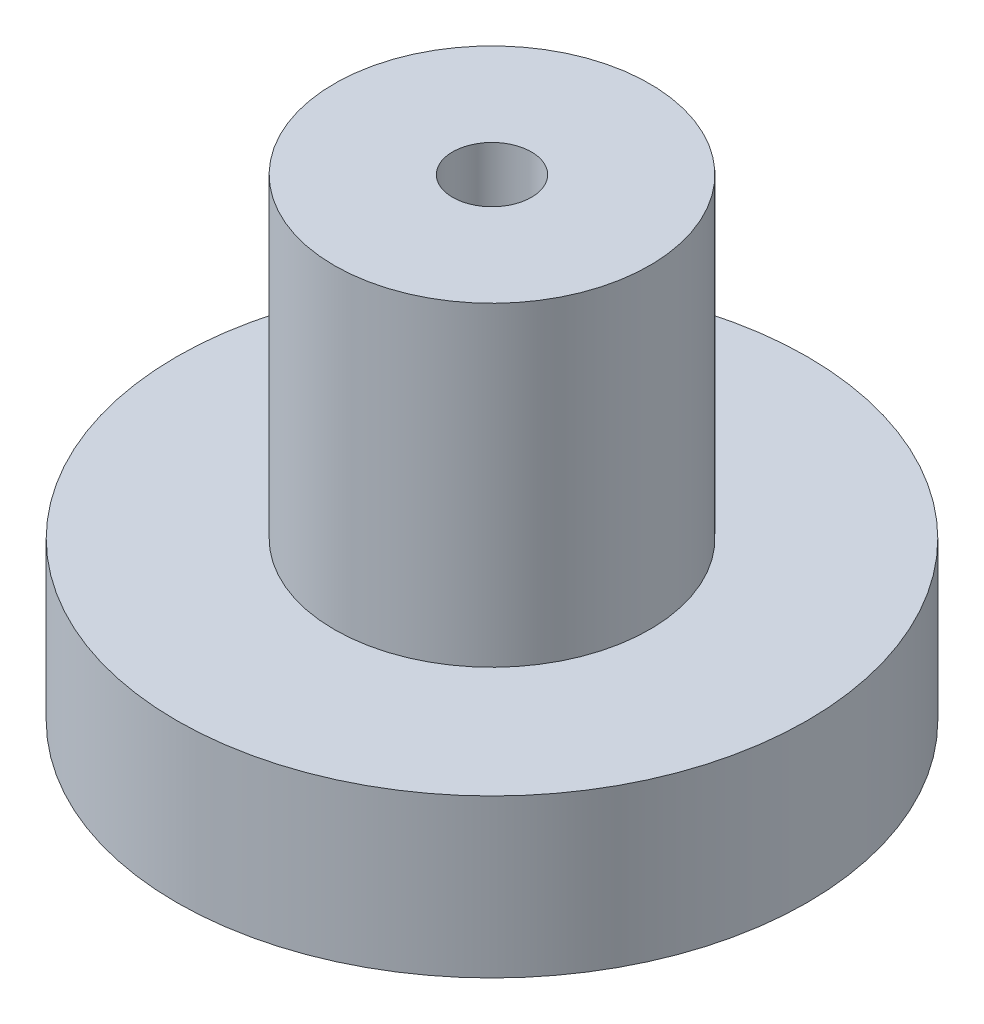
ISO-10303-21;
HEADER;
FILE_DESCRIPTION(('STEP AP214'),'2;1');
FILE_NAME('part.step','',(''),(''),'','','');
FILE_SCHEMA(('AUTOMOTIVE_DESIGN { 1 0 10303 214 1 1 1 1 }'));
ENDSEC;
DATA;
#1=APPLICATION_CONTEXT('core data for automotive mechanical design processes');
#2=APPLICATION_PROTOCOL_DEFINITION('international standard','automotive_design',2000,#1);
#3=PRODUCT_CONTEXT('',#1,'mechanical');
#4=PRODUCT('Part','Part','',(#3));
#5=PRODUCT_RELATED_PRODUCT_CATEGORY('part','',(#4));
#6=PRODUCT_DEFINITION_FORMATION('','',#4);
#7=PRODUCT_DEFINITION_CONTEXT('part definition',#1,'design');
#8=PRODUCT_DEFINITION('design','',#6,#7);
#9=PRODUCT_DEFINITION_SHAPE('','',#8);
#10=(LENGTH_UNIT() NAMED_UNIT(*) SI_UNIT(.MILLI.,.METRE.));
#11=(NAMED_UNIT(*) PLANE_ANGLE_UNIT() SI_UNIT($,.RADIAN.));
#12=(NAMED_UNIT(*) SI_UNIT($,.STERADIAN.) SOLID_ANGLE_UNIT());
#13=UNCERTAINTY_MEASURE_WITH_UNIT(LENGTH_MEASURE(1.E-05),#10,'distance_accuracy_value','');
#14=(GEOMETRIC_REPRESENTATION_CONTEXT(3) GLOBAL_UNCERTAINTY_ASSIGNED_CONTEXT((#13)) GLOBAL_UNIT_ASSIGNED_CONTEXT((#10,
#11,#12)) REPRESENTATION_CONTEXT('',''));
#15=CARTESIAN_POINT('',(0.,0.,0.));
#16=DIRECTION('',(0.,0.,1.));
#17=DIRECTION('',(1.,0.,0.));
#18=AXIS2_PLACEMENT_3D('',#15,#16,#17);
#19=CARTESIAN_POINT('',(0.,0.,0.));
#20=DIRECTION('',(0.,1.,0.));
#21=DIRECTION('',(0.,0.,1.));
#22=AXIS2_PLACEMENT_3D('',#19,#20,#21);
#23=CYLINDRICAL_SURFACE('',#22,0.396875);
#24=CARTESIAN_POINT('',(0.,4.7625,0.));
#25=DIRECTION('',(0.,1.,0.));
#26=DIRECTION('',(0.,0.,1.));
#27=AXIS2_PLACEMENT_3D('',#24,#25,#26);
#28=CIRCLE('',#27,0.396875);
#29=CARTESIAN_POINT('',(0.,4.7625,0.396875));
#30=VERTEX_POINT('',#29);
#31=EDGE_CURVE('E48',#30,#30,#28,.T.);
#32=ORIENTED_EDGE('',*,*,#31,.T.);
#33=EDGE_LOOP('',(#32));
#34=FACE_BOUND('',#33,.T.);
#35=CARTESIAN_POINT('',(0.,0.396875,0.));
#36=DIRECTION('',(0.,-1.,0.));
#37=DIRECTION('',(0.,0.,-1.));
#38=AXIS2_PLACEMENT_3D('',#35,#36,#37);
#39=CIRCLE('',#38,0.396875);
#40=CARTESIAN_POINT('',(0.,0.396875,-0.396875));
#41=VERTEX_POINT('',#40);
#42=EDGE_CURVE('E35',#41,#41,#39,.F.);
#43=ORIENTED_EDGE('',*,*,#42,.F.);
#44=EDGE_LOOP('',(#43));
#45=FACE_BOUND('',#44,.T.);
#46=ADVANCED_FACE('F31',(#34,#45),#23,.F.);
#47=CARTESIAN_POINT('',(0.,4.7625,0.));
#48=DIRECTION('',(0.,-1.,0.));
#49=DIRECTION('',(0.,0.,-1.));
#50=AXIS2_PLACEMENT_3D('',#47,#48,#49);
#51=CYLINDRICAL_SURFACE('',#50,3.175);
#52=CARTESIAN_POINT('',(0.,0.,0.));
#53=DIRECTION('',(0.,1.,0.));
#54=DIRECTION('',(0.,0.,1.));
#55=AXIS2_PLACEMENT_3D('',#52,#53,#54);
#56=CIRCLE('',#55,3.175);
#57=CARTESIAN_POINT('',(0.,0.,3.175));
#58=VERTEX_POINT('',#57);
#59=EDGE_CURVE('E10',#58,#58,#56,.T.);
#60=ORIENTED_EDGE('',*,*,#59,.T.);
#61=EDGE_LOOP('',(#60));
#62=FACE_BOUND('',#61,.T.);
#63=CARTESIAN_POINT('',(0.,1.5875,0.));
#64=DIRECTION('',(0.,1.,0.));
#65=DIRECTION('',(0.,0.,1.));
#66=AXIS2_PLACEMENT_3D('',#63,#64,#65);
#67=CIRCLE('',#66,3.175);
#68=CARTESIAN_POINT('',(0.,1.5875,3.175));
#69=VERTEX_POINT('',#68);
#70=EDGE_CURVE('E39',#69,#69,#67,.T.);
#71=ORIENTED_EDGE('',*,*,#70,.F.);
#72=EDGE_LOOP('',(#71));
#73=FACE_BOUND('',#72,.T.);
#74=ADVANCED_FACE('F33',(#62,#73),#51,.T.);
#75=CARTESIAN_POINT('',(0.,0.,0.));
#76=DIRECTION('',(0.,1.,0.));
#77=DIRECTION('',(0.,0.,1.));
#78=AXIS2_PLACEMENT_3D('',#75,#76,#77);
#79=PLANE('',#78);
#80=CARTESIAN_POINT('',(0.,0.,0.));
#81=DIRECTION('',(0.,-1.,0.));
#82=DIRECTION('',(0.,0.,-1.));
#83=AXIS2_PLACEMENT_3D('',#80,#81,#82);
#84=CIRCLE('',#83,0.79375);
#85=CARTESIAN_POINT('',(0.,0.,-0.79375));
#86=VERTEX_POINT('',#85);
#87=EDGE_CURVE('E54',#86,#86,#84,.T.);
#88=ORIENTED_EDGE('',*,*,#87,.F.);
#89=EDGE_LOOP('',(#88));
#90=FACE_BOUND('',#89,.T.);
#91=ORIENTED_EDGE('',*,*,#59,.F.);
#92=EDGE_LOOP('',(#91));
#93=FACE_BOUND('',#92,.T.);
#94=ADVANCED_FACE('F69',(#90,#93),#79,.F.);
#95=CARTESIAN_POINT('',(0.,1.5875,0.));
#96=DIRECTION('',(0.,1.,0.));
#97=DIRECTION('',(0.,0.,1.));
#98=AXIS2_PLACEMENT_3D('',#95,#96,#97);
#99=CYLINDRICAL_SURFACE('',#98,1.5875);
#100=CARTESIAN_POINT('',(0.,1.5875,0.));
#101=DIRECTION('',(0.,1.,0.));
#102=DIRECTION('',(0.,0.,1.));
#103=AXIS2_PLACEMENT_3D('',#100,#101,#102);
#104=CIRCLE('',#103,1.5875);
#105=CARTESIAN_POINT('',(0.,1.5875,1.5875));
#106=VERTEX_POINT('',#105);
#107=EDGE_CURVE('E43',#106,#106,#104,.T.);
#108=ORIENTED_EDGE('',*,*,#107,.T.);
#109=EDGE_LOOP('',(#108));
#110=FACE_BOUND('',#109,.T.);
#111=CARTESIAN_POINT('',(0.,4.7625,0.));
#112=DIRECTION('',(0.,1.,0.));
#113=DIRECTION('',(0.,0.,1.));
#114=AXIS2_PLACEMENT_3D('',#111,#112,#113);
#115=CIRCLE('',#114,1.5875);
#116=CARTESIAN_POINT('',(0.,4.7625,1.5875));
#117=VERTEX_POINT('',#116);
#118=EDGE_CURVE('E46',#117,#117,#115,.T.);
#119=ORIENTED_EDGE('',*,*,#118,.F.);
#120=EDGE_LOOP('',(#119));
#121=FACE_BOUND('',#120,.T.);
#122=ADVANCED_FACE('F76',(#110,#121),#99,.T.);
#123=CARTESIAN_POINT('',(0.,1.5875,0.));
#124=DIRECTION('',(0.,1.,0.));
#125=DIRECTION('',(0.,0.,1.));
#126=AXIS2_PLACEMENT_3D('',#123,#124,#125);
#127=PLANE('',#126);
#128=ORIENTED_EDGE('',*,*,#107,.F.);
#129=EDGE_LOOP('',(#128));
#130=FACE_BOUND('',#129,.T.);
#131=ORIENTED_EDGE('',*,*,#70,.T.);
#132=EDGE_LOOP('',(#131));
#133=FACE_BOUND('',#132,.T.);
#134=ADVANCED_FACE('F72',(#130,#133),#127,.T.);
#135=CARTESIAN_POINT('',(0.,4.7625,0.));
#136=DIRECTION('',(0.,1.,0.));
#137=DIRECTION('',(0.,0.,1.));
#138=AXIS2_PLACEMENT_3D('',#135,#136,#137);
#139=PLANE('',#138);
#140=ORIENTED_EDGE('',*,*,#31,.F.);
#141=EDGE_LOOP('',(#140));
#142=FACE_BOUND('',#141,.T.);
#143=ORIENTED_EDGE('',*,*,#118,.T.);
#144=EDGE_LOOP('',(#143));
#145=FACE_BOUND('',#144,.T.);
#146=ADVANCED_FACE('F75',(#142,#145),#139,.T.);
#147=CARTESIAN_POINT('',(0.,0.79375,0.));
#148=DIRECTION('',(0.,-1.,0.));
#149=DIRECTION('',(0.,0.,-1.));
#150=AXIS2_PLACEMENT_3D('',#147,#148,#149);
#151=CONICAL_SURFACE('',#150,0.,0.785398163397448);
#152=ORIENTED_EDGE('',*,*,#87,.T.);
#153=EDGE_LOOP('',(#152));
#154=FACE_BOUND('',#153,.T.);
#155=ORIENTED_EDGE('',*,*,#42,.T.);
#156=EDGE_LOOP('',(#155));
#157=FACE_BOUND('',#156,.T.);
#158=ADVANCED_FACE('F61',(#154,#157),#151,.F.);
#159=CLOSED_SHELL('',(#46,#74,#94,#122,#134,#146,#158));
#160=MANIFOLD_SOLID_BREP('B2',#159);
#161=ADVANCED_BREP_SHAPE_REPRESENTATION('',(#18,#160),#14);
#162=SHAPE_DEFINITION_REPRESENTATION(#9,#161);
ENDSEC;
END-ISO-10303-21;
